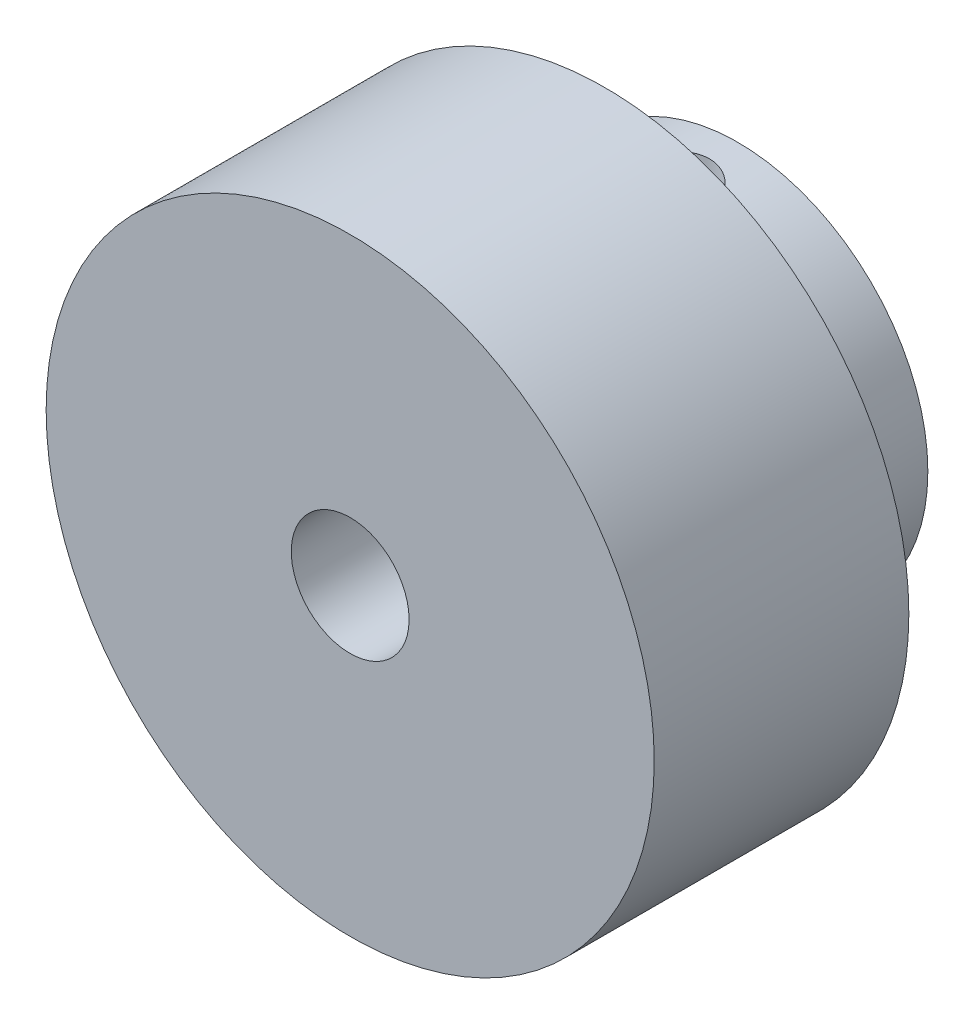
ISO-10303-21;
HEADER;
FILE_DESCRIPTION(('STEP AP214'),'2;1');
FILE_NAME('part.step','',(''),(''),'','','');
FILE_SCHEMA(('AUTOMOTIVE_DESIGN { 1 0 10303 214 1 1 1 1 }'));
ENDSEC;
DATA;
#1=APPLICATION_CONTEXT('core data for automotive mechanical design processes');
#2=APPLICATION_PROTOCOL_DEFINITION('international standard','automotive_design',2000,#1);
#3=PRODUCT_CONTEXT('',#1,'mechanical');
#4=PRODUCT('Part','Part','',(#3));
#5=PRODUCT_RELATED_PRODUCT_CATEGORY('part','',(#4));
#6=PRODUCT_DEFINITION_FORMATION('','',#4);
#7=PRODUCT_DEFINITION_CONTEXT('part definition',#1,'design');
#8=PRODUCT_DEFINITION('design','',#6,#7);
#9=PRODUCT_DEFINITION_SHAPE('','',#8);
#10=(LENGTH_UNIT() NAMED_UNIT(*) SI_UNIT(.MILLI.,.METRE.));
#11=(NAMED_UNIT(*) PLANE_ANGLE_UNIT() SI_UNIT($,.RADIAN.));
#12=(NAMED_UNIT(*) SI_UNIT($,.STERADIAN.) SOLID_ANGLE_UNIT());
#13=UNCERTAINTY_MEASURE_WITH_UNIT(LENGTH_MEASURE(1.E-05),#10,'distance_accuracy_value','');
#14=(GEOMETRIC_REPRESENTATION_CONTEXT(3) GLOBAL_UNCERTAINTY_ASSIGNED_CONTEXT((#13)) GLOBAL_UNIT_ASSIGNED_CONTEXT((#10,
#11,#12)) REPRESENTATION_CONTEXT('',''));
#15=CARTESIAN_POINT('',(0.,0.,0.));
#16=DIRECTION('',(0.,0.,1.));
#17=DIRECTION('',(1.,0.,0.));
#18=AXIS2_PLACEMENT_3D('',#15,#16,#17);
#19=CARTESIAN_POINT('',(0.,0.,-13.7));
#20=DIRECTION('',(0.,0.,1.));
#21=DIRECTION('',(-1.,0.,0.));
#22=AXIS2_PLACEMENT_3D('',#19,#20,#21);
#23=CYLINDRICAL_SURFACE('',#22,10.);
#24=CARTESIAN_POINT('',(0.,0.,-13.7));
#25=DIRECTION('',(0.,0.,1.));
#26=DIRECTION('',(1.,0.,0.));
#27=AXIS2_PLACEMENT_3D('',#24,#25,#26);
#28=CIRCLE('',#27,10.);
#29=CARTESIAN_POINT('',(10.,0.,-13.7));
#30=VERTEX_POINT('',#29);
#31=EDGE_CURVE('E71',#30,#30,#28,.T.);
#32=ORIENTED_EDGE('',*,*,#31,.T.);
#33=EDGE_LOOP('',(#32));
#34=FACE_BOUND('',#33,.T.);
#35=CARTESIAN_POINT('',(0.,0.,-6.7));
#36=DIRECTION('',(0.,0.,1.));
#37=DIRECTION('',(1.,0.,0.));
#38=AXIS2_PLACEMENT_3D('',#35,#36,#37);
#39=CIRCLE('',#38,10.);
#40=CARTESIAN_POINT('',(10.,0.,-6.7));
#41=VERTEX_POINT('',#40);
#42=EDGE_CURVE('E72',#41,#41,#39,.T.);
#43=ORIENTED_EDGE('',*,*,#42,.F.);
#44=EDGE_LOOP('',(#43));
#45=FACE_BOUND('',#44,.T.);
#46=CARTESIAN_POINT('',(0.,10.,-8.2));
#47=CARTESIAN_POINT('',(-0.111153813585266,9.99999795161742,-8.20000408899669));
#48=CARTESIAN_POINT('',(-0.222359320403044,9.99812770356462,-8.20929768593529));
#49=CARTESIAN_POINT('',(-0.441627015378038,9.99084731246463,-8.24619700023049));
#50=CARTESIAN_POINT('',(-0.549686635082711,9.98543435720372,-8.27381726560302));
#51=CARTESIAN_POINT('',(-0.759460610526626,9.97167298556573,-8.34648254724158));
#52=CARTESIAN_POINT('',(-0.861180935866267,9.96332738153436,-8.39151087368938));
#53=CARTESIAN_POINT('',(-1.05561597772845,9.94460796070629,-8.49766449502259));
#54=CARTESIAN_POINT('',(-1.14833123015162,9.93423426471414,-8.55878883121441));
#55=CARTESIAN_POINT('',(-1.32338695462973,9.9124433065994,-8.69627698858287));
#56=CARTESIAN_POINT('',(-1.40558790231705,9.90101491008695,-8.7728167107824));
#57=CARTESIAN_POINT('',(-1.55607351321606,9.87848360905177,-8.9385848327834));
#58=CARTESIAN_POINT('',(-1.62435708954085,9.86738073000848,-9.02781422267024));
#59=CARTESIAN_POINT('',(-1.74566350669524,9.8466488362523,-9.21743238602375));
#60=CARTESIAN_POINT('',(-1.79854187773173,9.83703414729892,-9.31791528759272));
#61=CARTESIAN_POINT('',(-1.88661133316062,9.82052536116836,-9.52656363800816));
#62=CARTESIAN_POINT('',(-1.92180416487448,9.81363099523923,-9.63472832669269));
#63=CARTESIAN_POINT('',(-1.97305059976965,9.80345610504409,-9.85416872781583));
#64=CARTESIAN_POINT('',(-1.98934899591755,9.80012940214375,-9.96538508828445));
#65=CARTESIAN_POINT('',(-2.00310425545224,9.79732750121254,-10.1890196427287));
#66=CARTESIAN_POINT('',(-2.000563045427,9.79785190935681,-10.3014377126403));
#67=CARTESIAN_POINT('',(-1.97690914620364,9.80265102296369,-10.522493576042));
#68=CARTESIAN_POINT('',(-1.95607708048781,9.80686905717527,-10.6311628112546));
#69=CARTESIAN_POINT('',(-1.8968757692461,9.81849092320002,-10.843432153326));
#70=CARTESIAN_POINT('',(-1.85850568620136,9.82589490715558,-10.947032017838));
#71=CARTESIAN_POINT('',(-1.76504956734944,9.84311237000816,-11.1470305234072));
#72=CARTESIAN_POINT('',(-1.70985230246423,9.85294179627409,-11.2433757591383));
#73=CARTESIAN_POINT('',(-1.58438714914536,9.87389237546124,-11.4255416999456));
#74=CARTESIAN_POINT('',(-1.51411752871366,9.88501367676732,-11.5113611937023));
#75=CARTESIAN_POINT('',(-1.35899986912117,9.90754042482924,-11.6716588049139));
#76=CARTESIAN_POINT('',(-1.27391232242489,9.9189473842181,-11.7459051357183));
#77=CARTESIAN_POINT('',(-1.09237004812402,9.94057697428817,-11.8791076926024));
#78=CARTESIAN_POINT('',(-0.99591517475878,9.95079958977947,-11.9380637225872));
#79=CARTESIAN_POINT('',(-0.794118773757843,9.96893380321774,-12.039055018452));
#80=CARTESIAN_POINT('',(-0.688763639170601,9.97684177696544,-12.0810637872891));
#81=CARTESIAN_POINT('',(-0.472297952897331,9.98942817975716,-12.1467209480771));
#82=CARTESIAN_POINT('',(-0.3611881001449,9.99410700001063,-12.1703715641473));
#83=CARTESIAN_POINT('',(-0.138358811254302,9.99965343733735,-12.1983129075886));
#84=CARTESIAN_POINT('',(-0.0266806566511532,10.0005834930494,-12.2029208390805));
#85=CARTESIAN_POINT('',(0.195849868385427,9.99870103860205,-12.1935002821156));
#86=CARTESIAN_POINT('',(0.306702284887586,9.99588873882892,-12.1794728412948));
#87=CARTESIAN_POINT('',(0.523411319893081,9.98687664016035,-12.1334432529121));
#88=CARTESIAN_POINT('',(0.629303896679805,9.98070752808413,-12.1016038630042));
#89=CARTESIAN_POINT('',(0.834247254999334,9.96567104122065,-12.0210320346884));
#90=CARTESIAN_POINT('',(0.933297523275078,9.95680346428454,-11.9722983306463));
#91=CARTESIAN_POINT('',(1.12308234737243,9.93719823066589,-11.8586350186974));
#92=CARTESIAN_POINT('',(1.21370025350438,9.92643900874104,-11.7935144379221));
#93=CARTESIAN_POINT('',(1.38283603823841,9.90429469659765,-11.6491816175854));
#94=CARTESIAN_POINT('',(1.46135261786152,9.89290953936776,-11.5699678672003));
#95=CARTESIAN_POINT('',(1.60528118154835,9.8705860711393,-11.3982532962178));
#96=CARTESIAN_POINT('',(1.67047540489731,9.85965720466609,-11.3055685115573));
#97=CARTESIAN_POINT('',(1.78437084010241,9.83968383592389,-11.1103772772866));
#98=CARTESIAN_POINT('',(1.8330727118458,9.83063925826685,-11.0078712208529));
#99=CARTESIAN_POINT('',(1.91230368316392,9.81553481168766,-10.7964635077009));
#100=CARTESIAN_POINT('',(1.9429269995821,9.80945949744373,-10.6875983175794));
#101=CARTESIAN_POINT('',(1.98541730325439,9.8009487358405,-10.4661330930182));
#102=CARTESIAN_POINT('',(1.99728673645022,9.79851281382223,-10.3535335475813));
#103=CARTESIAN_POINT('',(2.00184182173494,9.79758299262758,-10.1299822709114));
#104=CARTESIAN_POINT('',(1.99487157614179,9.79901838378602,-10.019037702146));
#105=CARTESIAN_POINT('',(1.96270460820012,9.80551146969228,-9.79993670018995));
#106=CARTESIAN_POINT('',(1.9375080322586,9.81056913534338,-9.69178024461039));
#107=CARTESIAN_POINT('',(1.86975713699791,9.82370528438317,-9.48154457751891));
#108=CARTESIAN_POINT('',(1.82724501343469,9.83177642037661,-9.37945127899517));
#109=CARTESIAN_POINT('',(1.72610928920321,9.85003429948341,-9.18379255853112));
#110=CARTESIAN_POINT('',(1.66748433754976,9.86022121997788,-9.09022785254973));
#111=CARTESIAN_POINT('',(1.53461182957283,9.88177921046451,-8.91256885569937));
#112=CARTESIAN_POINT('',(1.46011577447036,9.89316745819399,-8.82866246946481));
#113=CARTESIAN_POINT('',(1.29812873802628,9.91572163743909,-8.67442758894166));
#114=CARTESIAN_POINT('',(1.21063477430667,9.92688751726369,-8.60410221936546));
#115=CARTESIAN_POINT('',(1.02403525817649,9.94787664775943,-8.47833071210711));
#116=CARTESIAN_POINT('',(0.92481776885967,9.95768462438492,-8.42304799343995));
#117=CARTESIAN_POINT('',(0.718332721881466,9.9747025017,-8.33002775480682));
#118=CARTESIAN_POINT('',(0.611072521726253,9.98191474277232,-8.29227442093502));
#119=CARTESIAN_POINT('',(0.419642977847559,9.99152745190741,-8.24269610391057));
#120=CARTESIAN_POINT('',(0.336563328027569,9.99468606316904,-8.22671361258449));
#121=CARTESIAN_POINT('',(0.168999050420133,9.99892308279786,-8.20536417528327));
#122=CARTESIAN_POINT('',(0.0845144674972378,10.0000015574631,-8.19999689098047));
#123=CARTESIAN_POINT('',(0.,10.,-8.2));
#124=B_SPLINE_CURVE_WITH_KNOTS('',3,(#46,#47,#48,#49,#50,#51,#52,#53,#54,#55,#56,#57,#58,#59,
#60,#61,#62,#63,#64,#65,#66,#67,#68,#69,#70,#71,#72,#73,#74,#75,#76,#77,#78,#79,#80,#81,#82,#83,
#84,#85,#86,#87,#88,#89,#90,#91,#92,#93,#94,#95,#96,#97,#98,#99,#100,#101,#102,#103,#104,#105,
#106,#107,#108,#109,#110,#111,#112,#113,#114,#115,#116,#117,#118,#119,#120,#121,#122,#123),
.UNSPECIFIED.,.T.,.F.,(4,2,2,2,2,2,2,2,2,2,2,2,2,2,2,2,2,2,2,2,2,2,2,2,2,2,2,2,2,2,2,2,2,2,2,2,
2,2,4),(0.,0.333152261322516,0.666569301382645,0.999667470500682,1.33274580446173,
1.66986534022437,2.00701119349473,2.34722390011845,2.68740298730395,3.02312370207175,
3.3588100856245,3.68943454012557,4.02007478507459,4.35294980407185,4.68586309499341,
5.02476504982701,5.3636713507964,5.70310549708048,6.04249851396072,6.3762147135253,
6.70991215315735,7.04060907901447,7.37133078432045,7.70610132066717,8.0409077669186,
8.38081257158451,8.72070377446933,9.05880762065446,9.39686736660829,9.72879445135402,
10.0607188698522,10.3918392250622,10.7229873516373,11.0597615247829,11.3966130906586,
11.7369899335127,12.0770591103504,12.3303755057979,12.5836838274199),.UNSPECIFIED.);
#125=CARTESIAN_POINT('',(0.,10.,-8.2));
#126=VERTEX_POINT('',#125);
#127=EDGE_CURVE('E81',#126,#126,#124,.T.);
#128=ORIENTED_EDGE('',*,*,#127,.T.);
#129=EDGE_LOOP('',(#128));
#130=FACE_BOUND('',#129,.T.);
#131=ADVANCED_FACE('F34',(#34,#45,#130),#23,.T.);
#132=CARTESIAN_POINT('',(0.,0.,-13.7));
#133=DIRECTION('',(0.,0.,1.));
#134=DIRECTION('',(-1.,0.,0.));
#135=AXIS2_PLACEMENT_3D('',#132,#133,#134);
#136=CYLINDRICAL_SURFACE('',#135,3.025);
#137=CARTESIAN_POINT('',(0.,0.,-6.7));
#138=DIRECTION('',(0.,0.,1.));
#139=DIRECTION('',(1.,0.,0.));
#140=AXIS2_PLACEMENT_3D('',#137,#138,#139);
#141=CIRCLE('',#140,3.025);
#142=CARTESIAN_POINT('',(3.025,0.,-6.7));
#143=VERTEX_POINT('',#142);
#144=EDGE_CURVE('E78',#143,#143,#141,.T.);
#145=ORIENTED_EDGE('',*,*,#144,.T.);
#146=EDGE_LOOP('',(#145));
#147=FACE_BOUND('',#146,.T.);
#148=CARTESIAN_POINT('',(0.,0.,-13.7));
#149=DIRECTION('',(0.,0.,1.));
#150=DIRECTION('',(1.,0.,0.));
#151=AXIS2_PLACEMENT_3D('',#148,#149,#150);
#152=CIRCLE('',#151,3.025);
#153=CARTESIAN_POINT('',(3.025,0.,-13.7));
#154=VERTEX_POINT('',#153);
#155=EDGE_CURVE('E75',#154,#154,#152,.T.);
#156=ORIENTED_EDGE('',*,*,#155,.F.);
#157=EDGE_LOOP('',(#156));
#158=FACE_BOUND('',#157,.T.);
#159=CARTESIAN_POINT('',(0.,3.025,-8.2));
#160=CARTESIAN_POINT('',(-0.100642617545443,3.0249987783567,-8.20000120399706));
#161=CARTESIAN_POINT('',(-0.201297476451969,3.01993299908086,-8.20763918314828));
#162=CARTESIAN_POINT('',(-0.399407420799123,3.00017112360042,-8.23772383693425));
#163=CARTESIAN_POINT('',(-0.496860581658117,2.98546934240776,-8.26017925352084));
#164=CARTESIAN_POINT('',(-0.685406514791431,2.94788928584531,-8.31853239841244));
#165=CARTESIAN_POINT('',(-0.77652679162158,2.9250494038349,-8.35436704448431));
#166=CARTESIAN_POINT('',(-0.951102248223408,2.87303630646243,-8.43796086625516));
#167=CARTESIAN_POINT('',(-1.03455640299659,2.84386224593824,-8.48572163337046));
#168=CARTESIAN_POINT('',(-1.1993664317277,2.77860517215513,-8.59619850933004));
#169=CARTESIAN_POINT('',(-1.27995339778043,2.74214718793265,-8.65983549631194));
#170=CARTESIAN_POINT('',(-1.43004114549588,2.66695898812271,-8.79806837761625));
#171=CARTESIAN_POINT('',(-1.49952590979975,2.62822559792703,-8.87267981240007));
#172=CARTESIAN_POINT('',(-1.63642694811529,2.54559569213749,-9.04416649867465));
#173=CARTESIAN_POINT('',(-1.70185902015384,2.50182778570157,-9.14270030985283));
#174=CARTESIAN_POINT('',(-1.81513895163526,2.42089760145931,-9.35185343247864));
#175=CARTESIAN_POINT('',(-1.86301722866889,2.38372395524591,-9.4624514031127));
#176=CARTESIAN_POINT('',(-1.92790941909835,2.33131127968343,-9.66080288815675));
#177=CARTESIAN_POINT('',(-1.94983031145749,2.3128404086022,-9.74608882179241));
#178=CARTESIAN_POINT('',(-1.98230173644163,2.28507624082387,-9.92019621834675));
#179=CARTESIAN_POINT('',(-1.99287137832762,2.27576752231628,-10.0090114775415));
#180=CARTESIAN_POINT('',(-2.00197996643278,2.26776224993919,-10.188102308303));
#181=CARTESIAN_POINT('',(-2.00047243567843,2.26910669275792,-10.2783821857446));
#182=CARTESIAN_POINT('',(-1.98542700585713,2.28227832992203,-10.4571854861868));
#183=CARTESIAN_POINT('',(-1.97187893783001,2.29411438504498,-10.5457073598269));
#184=CARTESIAN_POINT('',(-1.93441748703559,2.32577203848501,-10.7150249556095));
#185=CARTESIAN_POINT('',(-1.91095118389035,2.3452468580049,-10.7959886169975));
#186=CARTESIAN_POINT('',(-1.85474587741065,2.38994328199187,-10.9529093217787));
#187=CARTESIAN_POINT('',(-1.82200382976829,2.41516677264586,-11.0288647113465));
#188=CARTESIAN_POINT('',(-1.74062365832931,2.47464586658619,-11.189914970672));
#189=CARTESIAN_POINT('',(-1.69011177897742,2.50969726935146,-11.2737667143711));
#190=CARTESIAN_POINT('',(-1.57789269135683,2.58173148940282,-11.4327776291153));
#191=CARTESIAN_POINT('',(-1.51617174973991,2.61871663588472,-11.5079259496748));
#192=CARTESIAN_POINT('',(-1.36825223388174,2.69944551804657,-11.6634469856888));
#193=CARTESIAN_POINT('',(-1.27963305562048,2.74299173909087,-11.7416455785507));
#194=CARTESIAN_POINT('',(-1.08829088468167,2.82436277312043,-11.8821621524632));
#195=CARTESIAN_POINT('',(-0.985581704313,2.86219311394096,-11.9444955172644));
#196=CARTESIAN_POINT('',(-0.789532778941588,2.92157423058359,-12.0401294705185));
#197=CARTESIAN_POINT('',(-0.698331651394648,2.9448638502207,-12.0767301836017));
#198=CARTESIAN_POINT('',(-0.509974561365827,2.98324682151488,-12.1364045017915));
#199=CARTESIAN_POINT('',(-0.412823666926969,2.99834704378092,-12.1594894474371));
#200=CARTESIAN_POINT('',(-0.214732767837394,3.01901724877256,-12.1909754675224));
#201=CARTESIAN_POINT('',(-0.113778916602817,3.02454808313808,-12.1993162265056));
#202=CARTESIAN_POINT('',(0.0882749032008229,3.02539816006898,-12.2006024658699));
#203=CARTESIAN_POINT('',(0.1893748658806,3.02071780334157,-12.1935485503683));
#204=CARTESIAN_POINT('',(0.381767939018034,3.00226630998737,-12.1654713815535));
#205=CARTESIAN_POINT('',(0.473265865733124,2.9891210741874,-12.1454093059232));
#206=CARTESIAN_POINT('',(0.651304981345677,2.95544286376606,-12.0932545777779));
#207=CARTESIAN_POINT('',(0.737845372463182,2.93490870394887,-12.0611599951939));
#208=CARTESIAN_POINT('',(0.90967129636838,2.88645021717455,-11.9837986244011));
#209=CARTESIAN_POINT('',(0.994525548315691,2.85813838308447,-11.9378228543548));
#210=CARTESIAN_POINT('',(1.15562685582589,2.79688987995517,-11.8351349952313));
#211=CARTESIAN_POINT('',(1.23186824324879,2.76395019694144,-11.7784159009105));
#212=CARTESIAN_POINT('',(1.38625078703641,2.69023227350938,-11.6457657904491));
#213=CARTESIAN_POINT('',(1.46280246171431,2.64903627604967,-11.5682160416802));
#214=CARTESIAN_POINT('',(1.60248518218092,2.56694988781008,-11.4016111254721));
#215=CARTESIAN_POINT('',(1.66560818311131,2.52605969430336,-11.3125491123265));
#216=CARTESIAN_POINT('',(1.77180282800471,2.45256947866062,-11.1330116479057));
#217=CARTESIAN_POINT('',(1.816225542226,2.41955004513944,-11.0435113156178));
#218=CARTESIAN_POINT('',(1.89174612763738,2.36097775731043,-10.8568040613348));
#219=CARTESIAN_POINT('',(1.92286805386102,2.33541145056868,-10.7596114318735));
#220=CARTESIAN_POINT('',(1.96611703059194,2.29905930446256,-10.5763918780719));
#221=CARTESIAN_POINT('',(1.98057383955256,2.2864996133779,-10.491275789339));
#222=CARTESIAN_POINT('',(1.99832459579881,2.27100707562215,-10.3190500244278));
#223=CARTESIAN_POINT('',(2.00162949221253,2.26806478651924,-10.2319423882528));
#224=CARTESIAN_POINT('',(1.99686400840466,2.27226006140056,-10.0582863660211));
#225=CARTESIAN_POINT('',(1.98879215912862,2.27939892714264,-9.97173805363841));
#226=CARTESIAN_POINT('',(1.96180765860033,2.30265967673578,-9.80155537000174));
#227=CARTESIAN_POINT('',(1.94288066764141,2.31879344211434,-9.7179250087073));
#228=CARTESIAN_POINT('',(1.88853640463144,2.36338668506866,-9.53281773634975));
#229=CARTESIAN_POINT('',(1.85000940230073,2.39401916394776,-9.43278671871945));
#230=CARTESIAN_POINT('',(1.75875296775858,2.4618364901973,-9.24186280751888));
#231=CARTESIAN_POINT('',(1.70600376756291,2.49903043253554,-9.15098287671915));
#232=CARTESIAN_POINT('',(1.58660143921209,2.57652397210842,-8.97772806406637));
#233=CARTESIAN_POINT('',(1.51972274368281,2.61686628824138,-8.89552830736306));
#234=CARTESIAN_POINT('',(1.37352970310745,2.69647449530486,-8.7423909046251));
#235=CARTESIAN_POINT('',(1.29421174234045,2.73574006934784,-8.67145654520685));
#236=CARTESIAN_POINT('',(1.11295786075,2.81477128758288,-8.53390374857185));
#237=CARTESIAN_POINT('',(1.00942412682183,2.85394790411945,-8.46902276178671));
#238=CARTESIAN_POINT('',(0.789646169800199,2.9223698098855,-8.3583946535448));
#239=CARTESIAN_POINT('',(0.673425510575367,2.95163311005192,-8.31261279654635));
#240=CARTESIAN_POINT('',(0.46395446902743,2.99057955194841,-8.25235804291387));
#241=CARTESIAN_POINT('',(0.372726683285131,3.00339087807589,-8.23281288538721));
#242=CARTESIAN_POINT('',(0.187668467681292,3.02059926936491,-8.20663698970701));
#243=CARTESIAN_POINT('',(0.0938395550181361,3.02500113906481,-8.19999887738861));
#244=CARTESIAN_POINT('',(0.,3.025,-8.2));
#245=B_SPLINE_CURVE_WITH_KNOTS('',3,(#159,#160,#161,#162,#163,#164,#165,#166,#167,#168,#169,
#170,#171,#172,#173,#174,#175,#176,#177,#178,#179,#180,#181,#182,#183,#184,#185,#186,#187,#188,
#189,#190,#191,#192,#193,#194,#195,#196,#197,#198,#199,#200,#201,#202,#203,#204,#205,#206,#207,
#208,#209,#210,#211,#212,#213,#214,#215,#216,#217,#218,#219,#220,#221,#222,#223,#224,#225,#226,
#227,#228,#229,#230,#231,#232,#233,#234,#235,#236,#237,#238,#239,#240,#241,#242,#243,#244),
.UNSPECIFIED.,.T.,.F.,(4,2,2,2,2,2,2,2,2,2,2,2,2,2,2,2,2,2,2,2,2,2,2,2,2,2,2,2,2,2,2,2,2,2,2,2,
2,2,2,2,2,2,4),(0.,0.3015487261854,0.603275518532284,0.90359729337094,1.20395916445007,
1.5296221539219,1.85575082198353,2.23234945588228,2.60829239236122,2.87713902044293,
3.14553234581872,3.41495903262255,3.6846134829861,3.94322790551536,4.20192730406333,
4.51276392728465,4.8239839889588,5.20005220793539,5.57575437031097,5.87746307605225,
6.17891826595883,6.4816038183107,6.78427749289962,7.06680260771109,7.3493730602407,
7.64994767467169,7.95071895936768,8.29882678891969,8.64714257948896,8.96167116055969,
9.27562847127144,9.53621105204698,9.79653771407239,10.0568979945935,10.3176030073973,
10.6502710247593,10.983403835499,11.3223223758499,11.6613396128591,12.0440942372523,
12.4261496795824,12.7074756225657,12.9886407886918),.UNSPECIFIED.);
#246=CARTESIAN_POINT('',(0.,3.025,-8.2));
#247=VERTEX_POINT('',#246);
#248=EDGE_CURVE('E38',#247,#247,#245,.T.);
#249=ORIENTED_EDGE('',*,*,#248,.F.);
#250=EDGE_LOOP('',(#249));
#251=FACE_BOUND('',#250,.T.);
#252=ADVANCED_FACE('F95',(#147,#158,#251),#136,.F.);
#253=CARTESIAN_POINT('',(0.,0.,-6.7));
#254=DIRECTION('',(0.,0.,-1.));
#255=DIRECTION('',(1.,0.,0.));
#256=AXIS2_PLACEMENT_3D('',#253,#254,#255);
#257=PLANE('',#256);
#258=ORIENTED_EDGE('',*,*,#42,.T.);
#259=EDGE_LOOP('',(#258));
#260=FACE_BOUND('',#259,.T.);
#261=CARTESIAN_POINT('',(0.,0.,-6.7));
#262=DIRECTION('',(0.,0.,1.));
#263=DIRECTION('',(1.,0.,0.));
#264=AXIS2_PLACEMENT_3D('',#261,#262,#263);
#265=CIRCLE('',#264,16.);
#266=CARTESIAN_POINT('',(16.,0.,-6.7));
#267=VERTEX_POINT('',#266);
#268=EDGE_CURVE('E10',#267,#267,#265,.T.);
#269=ORIENTED_EDGE('',*,*,#268,.F.);
#270=EDGE_LOOP('',(#269));
#271=FACE_BOUND('',#270,.T.);
#272=ADVANCED_FACE('F120',(#260,#271),#257,.T.);
#273=CARTESIAN_POINT('',(0.,0.,6.7));
#274=DIRECTION('',(0.,0.,-1.));
#275=DIRECTION('',(1.,0.,0.));
#276=AXIS2_PLACEMENT_3D('',#273,#274,#275);
#277=PLANE('',#276);
#278=CARTESIAN_POINT('',(0.,0.,6.7));
#279=DIRECTION('',(0.,0.,1.));
#280=DIRECTION('',(1.,0.,0.));
#281=AXIS2_PLACEMENT_3D('',#278,#279,#280);
#282=CIRCLE('',#281,16.);
#283=CARTESIAN_POINT('',(16.,0.,6.7));
#284=VERTEX_POINT('',#283);
#285=EDGE_CURVE('E47',#284,#284,#282,.T.);
#286=ORIENTED_EDGE('',*,*,#285,.T.);
#287=EDGE_LOOP('',(#286));
#288=FACE_BOUND('',#287,.T.);
#289=CARTESIAN_POINT('',(0.,0.,6.7));
#290=DIRECTION('',(0.,0.,1.));
#291=DIRECTION('',(1.,0.,0.));
#292=AXIS2_PLACEMENT_3D('',#289,#290,#291);
#293=CIRCLE('',#292,3.1);
#294=CARTESIAN_POINT('',(3.1,0.,6.7));
#295=VERTEX_POINT('',#294);
#296=EDGE_CURVE('E52',#295,#295,#293,.T.);
#297=ORIENTED_EDGE('',*,*,#296,.F.);
#298=EDGE_LOOP('',(#297));
#299=FACE_BOUND('',#298,.T.);
#300=ADVANCED_FACE('F122',(#288,#299),#277,.F.);
#301=CARTESIAN_POINT('',(0.,0.,-6.7));
#302=DIRECTION('',(0.,0.,1.));
#303=DIRECTION('',(-1.,0.,0.));
#304=AXIS2_PLACEMENT_3D('',#301,#302,#303);
#305=CYLINDRICAL_SURFACE('',#304,16.);
#306=ORIENTED_EDGE('',*,*,#268,.T.);
#307=EDGE_LOOP('',(#306));
#308=FACE_BOUND('',#307,.T.);
#309=ORIENTED_EDGE('',*,*,#285,.F.);
#310=EDGE_LOOP('',(#309));
#311=FACE_BOUND('',#310,.T.);
#312=ADVANCED_FACE('F36',(#308,#311),#305,.T.);
#313=CARTESIAN_POINT('',(0.,0.,-6.7));
#314=DIRECTION('',(0.,0.,1.));
#315=DIRECTION('',(-1.,0.,0.));
#316=AXIS2_PLACEMENT_3D('',#313,#314,#315);
#317=CYLINDRICAL_SURFACE('',#316,3.1);
#318=CARTESIAN_POINT('',(0.,0.,-6.7));
#319=DIRECTION('',(0.,0.,1.));
#320=DIRECTION('',(1.,0.,0.));
#321=AXIS2_PLACEMENT_3D('',#318,#319,#320);
#322=CIRCLE('',#321,3.1);
#323=CARTESIAN_POINT('',(3.1,0.,-6.7));
#324=VERTEX_POINT('',#323);
#325=EDGE_CURVE('E66',#324,#324,#322,.T.);
#326=ORIENTED_EDGE('',*,*,#325,.F.);
#327=EDGE_LOOP('',(#326));
#328=FACE_BOUND('',#327,.T.);
#329=ORIENTED_EDGE('',*,*,#296,.T.);
#330=EDGE_LOOP('',(#329));
#331=FACE_BOUND('',#330,.T.);
#332=ADVANCED_FACE('F116',(#328,#331),#317,.F.);
#333=CARTESIAN_POINT('',(0.,0.,-6.7));
#334=DIRECTION('',(0.,0.,-1.));
#335=DIRECTION('',(1.,0.,0.));
#336=AXIS2_PLACEMENT_3D('',#333,#334,#335);
#337=PLANE('',#336);
#338=ORIENTED_EDGE('',*,*,#144,.F.);
#339=EDGE_LOOP('',(#338));
#340=FACE_BOUND('',#339,.T.);
#341=ORIENTED_EDGE('',*,*,#325,.T.);
#342=EDGE_LOOP('',(#341));
#343=FACE_BOUND('',#342,.T.);
#344=ADVANCED_FACE('F97',(#340,#343),#337,.F.);
#345=CARTESIAN_POINT('',(0.,0.,-13.7));
#346=DIRECTION('',(0.,0.,-1.));
#347=DIRECTION('',(1.,0.,0.));
#348=AXIS2_PLACEMENT_3D('',#345,#346,#347);
#349=PLANE('',#348);
#350=ORIENTED_EDGE('',*,*,#31,.F.);
#351=EDGE_LOOP('',(#350));
#352=FACE_BOUND('',#351,.T.);
#353=ORIENTED_EDGE('',*,*,#155,.T.);
#354=EDGE_LOOP('',(#353));
#355=FACE_BOUND('',#354,.T.);
#356=ADVANCED_FACE('F146',(#352,#355),#349,.T.);
#357=CARTESIAN_POINT('',(0.,16.,-10.2));
#358=DIRECTION('',(0.,-1.,0.));
#359=DIRECTION('',(0.,0.,1.));
#360=AXIS2_PLACEMENT_3D('',#357,#358,#359);
#361=CYLINDRICAL_SURFACE('',#360,2.);
#362=ORIENTED_EDGE('',*,*,#248,.T.);
#363=EDGE_LOOP('',(#362));
#364=FACE_BOUND('',#363,.T.);
#365=ORIENTED_EDGE('',*,*,#127,.F.);
#366=EDGE_LOOP('',(#365));
#367=FACE_BOUND('',#366,.T.);
#368=ADVANCED_FACE('F89',(#364,#367),#361,.F.);
#369=CLOSED_SHELL('',(#131,#252,#272,#300,#312,#332,#344,#356,#368));
#370=CARTESIAN_POINT('',(0.,0.,5.15));
#371=DIRECTION('',(0.,0.,-1.));
#372=DIRECTION('',(1.,0.,0.));
#373=AXIS2_PLACEMENT_3D('',#370,#371,#372);
#374=CYLINDRICAL_SURFACE('',#373,13.6604075348495);
#375=CARTESIAN_POINT('',(0.,0.,5.15));
#376=DIRECTION('',(0.,0.,1.));
#377=DIRECTION('',(1.,0.,0.));
#378=AXIS2_PLACEMENT_3D('',#375,#376,#377);
#379=CIRCLE('',#378,13.6604075348495);
#380=CARTESIAN_POINT('',(13.6604075348495,0.,5.15));
#381=VERTEX_POINT('',#380);
#382=EDGE_CURVE('E56',#381,#381,#379,.T.);
#383=CARTESIAN_POINT('',(0.,0.,-5.15));
#384=DIRECTION('',(0.,0.,1.));
#385=DIRECTION('',(1.,0.,0.));
#386=AXIS2_PLACEMENT_3D('',#383,#384,#385);
#387=CIRCLE('',#386,13.6604075348495);
#388=CARTESIAN_POINT('',(13.6604075348495,0.,-5.15));
#389=VERTEX_POINT('',#388);
#390=EDGE_CURVE('E57',#389,#389,#387,.T.);
#391=CARTESIAN_POINT('',(13.6604075348495,0.,5.15));
#392=CARTESIAN_POINT('',(13.6604075348495,0.,5.04270833333333));
#393=CARTESIAN_POINT('',(13.6604075348495,0.,4.93541666666667));
#394=CARTESIAN_POINT('',(13.6604075348495,0.,4.72083333333333));
#395=CARTESIAN_POINT('',(13.6604075348495,0.,4.61354166666667));
#396=CARTESIAN_POINT('',(13.6604075348495,0.,4.39895833333333));
#397=CARTESIAN_POINT('',(13.6604075348495,0.,4.29166666666667));
#398=CARTESIAN_POINT('',(13.6604075348495,0.,4.07708333333333));
#399=CARTESIAN_POINT('',(13.6604075348495,0.,3.96979166666667));
#400=CARTESIAN_POINT('',(13.6604075348495,0.,3.75520833333333));
#401=CARTESIAN_POINT('',(13.6604075348495,0.,3.64791666666667));
#402=CARTESIAN_POINT('',(13.6604075348495,0.,3.43333333333333));
#403=CARTESIAN_POINT('',(13.6604075348495,0.,3.32604166666667));
#404=CARTESIAN_POINT('',(13.6604075348495,0.,3.11145833333333));
#405=CARTESIAN_POINT('',(13.6604075348495,0.,3.00416666666667));
#406=CARTESIAN_POINT('',(13.6604075348495,0.,2.78958333333333));
#407=CARTESIAN_POINT('',(13.6604075348495,0.,2.68229166666667));
#408=CARTESIAN_POINT('',(13.6604075348495,0.,2.46770833333333));
#409=CARTESIAN_POINT('',(13.6604075348495,0.,2.36041666666667));
#410=CARTESIAN_POINT('',(13.6604075348495,0.,2.14583333333333));
#411=CARTESIAN_POINT('',(13.6604075348495,0.,2.03854166666667));
#412=CARTESIAN_POINT('',(13.6604075348495,0.,1.82395833333333));
#413=CARTESIAN_POINT('',(13.6604075348495,0.,1.71666666666667));
#414=CARTESIAN_POINT('',(13.6604075348495,0.,1.50208333333333));
#415=CARTESIAN_POINT('',(13.6604075348495,0.,1.39479166666667));
#416=CARTESIAN_POINT('',(13.6604075348495,0.,1.18020833333333));
#417=CARTESIAN_POINT('',(13.6604075348495,0.,1.07291666666667));
#418=CARTESIAN_POINT('',(13.6604075348495,0.,0.858333333333332));
#419=CARTESIAN_POINT('',(13.6604075348495,0.,0.751041666666665));
#420=CARTESIAN_POINT('',(13.6604075348495,0.,0.536458333333332));
#421=CARTESIAN_POINT('',(13.6604075348495,0.,0.429166666666665));
#422=CARTESIAN_POINT('',(13.6604075348495,0.,0.214583333333332));
#423=CARTESIAN_POINT('',(13.6604075348495,0.,0.107291666666665));
#424=CARTESIAN_POINT('',(13.6604075348495,0.,-0.107291666666668));
#425=CARTESIAN_POINT('',(13.6604075348495,0.,-0.214583333333335));
#426=CARTESIAN_POINT('',(13.6604075348495,0.,-0.429166666666669));
#427=CARTESIAN_POINT('',(13.6604075348495,0.,-0.536458333333335));
#428=CARTESIAN_POINT('',(13.6604075348495,0.,-0.751041666666669));
#429=CARTESIAN_POINT('',(13.6604075348495,0.,-0.858333333333335));
#430=CARTESIAN_POINT('',(13.6604075348495,0.,-1.07291666666667));
#431=CARTESIAN_POINT('',(13.6604075348495,0.,-1.18020833333334));
#432=CARTESIAN_POINT('',(13.6604075348495,0.,-1.39479166666667));
#433=CARTESIAN_POINT('',(13.6604075348495,0.,-1.50208333333334));
#434=CARTESIAN_POINT('',(13.6604075348495,0.,-1.71666666666667));
#435=CARTESIAN_POINT('',(13.6604075348495,0.,-1.82395833333334));
#436=CARTESIAN_POINT('',(13.6604075348495,0.,-2.03854166666667));
#437=CARTESIAN_POINT('',(13.6604075348495,0.,-2.14583333333334));
#438=CARTESIAN_POINT('',(13.6604075348495,0.,-2.36041666666667));
#439=CARTESIAN_POINT('',(13.6604075348495,0.,-2.46770833333334));
#440=CARTESIAN_POINT('',(13.6604075348495,0.,-2.68229166666667));
#441=CARTESIAN_POINT('',(13.6604075348495,0.,-2.78958333333333));
#442=CARTESIAN_POINT('',(13.6604075348495,0.,-3.00416666666667));
#443=CARTESIAN_POINT('',(13.6604075348495,0.,-3.11145833333333));
#444=CARTESIAN_POINT('',(13.6604075348495,0.,-3.32604166666667));
#445=CARTESIAN_POINT('',(13.6604075348495,0.,-3.43333333333333));
#446=CARTESIAN_POINT('',(13.6604075348495,0.,-3.64791666666667));
#447=CARTESIAN_POINT('',(13.6604075348495,0.,-3.75520833333333));
#448=CARTESIAN_POINT('',(13.6604075348495,0.,-3.96979166666667));
#449=CARTESIAN_POINT('',(13.6604075348495,0.,-4.07708333333333));
#450=CARTESIAN_POINT('',(13.6604075348495,0.,-4.29166666666667));
#451=CARTESIAN_POINT('',(13.6604075348495,0.,-4.39895833333333));
#452=CARTESIAN_POINT('',(13.6604075348495,0.,-4.61354166666667));
#453=CARTESIAN_POINT('',(13.6604075348495,0.,-4.72083333333334));
#454=CARTESIAN_POINT('',(13.6604075348495,0.,-4.93541666666667));
#455=CARTESIAN_POINT('',(13.6604075348495,0.,-5.04270833333334));
#456=CARTESIAN_POINT('',(13.6604075348495,0.,-5.15));
#457=B_SPLINE_CURVE_WITH_KNOTS('',3,(#391,#392,#393,#394,#395,#396,#397,#398,#399,#400,#401,
#402,#403,#404,#405,#406,#407,#408,#409,#410,#411,#412,#413,#414,#415,#416,#417,#418,#419,#420,
#421,#422,#423,#424,#425,#426,#427,#428,#429,#430,#431,#432,#433,#434,#435,#436,#437,#438,#439,
#440,#441,#442,#443,#444,#445,#446,#447,#448,#449,#450,#451,#452,#453,#454,#455,#456),
.UNSPECIFIED.,.F.,.F.,(4,2,2,2,2,2,2,2,2,2,2,2,2,2,2,2,2,2,2,2,2,2,2,2,2,2,2,2,2,2,2,2,4),(0.,
0.321874999999999,0.643749999999999,0.965625,1.2875,1.609375,1.93125,2.253125,2.575,2.896875,
3.21875,3.540625,3.8625,4.184375,4.50625,4.828125,5.15,5.471875,5.79375,6.115625,6.4375,
6.759375,7.08125,7.403125,7.725,8.046875,8.36875,8.690625,9.0125,9.334375,9.65625,9.978125,
10.3),.UNSPECIFIED.);
#458=EDGE_CURVE('BSEAM108',#381,#389,#457,.T.);
#459=ORIENTED_EDGE('',*,*,#382,.T.);
#460=ORIENTED_EDGE('',*,*,#390,.F.);
#461=ORIENTED_EDGE('',*,*,#458,.T.);
#462=ORIENTED_EDGE('',*,*,#458,.F.);
#463=EDGE_LOOP('',(#459,#461,#460,#462));
#464=FACE_BOUND('',#463,.T.);
#465=ADVANCED_FACE('F108',(#464),#374,.F.);
#466=CARTESIAN_POINT('',(0.,0.,5.15));
#467=DIRECTION('',(0.,0.,-1.));
#468=DIRECTION('',(1.,0.,0.));
#469=AXIS2_PLACEMENT_3D('',#466,#467,#468);
#470=PLANE('',#469);
#471=CARTESIAN_POINT('',(0.,0.,5.15));
#472=DIRECTION('',(0.,0.,1.));
#473=DIRECTION('',(1.,0.,0.));
#474=AXIS2_PLACEMENT_3D('',#471,#472,#473);
#475=CIRCLE('',#474,7.85);
#476=CARTESIAN_POINT('',(7.85,0.,5.15));
#477=VERTEX_POINT('',#476);
#478=EDGE_CURVE('E60',#477,#477,#475,.T.);
#479=ORIENTED_EDGE('',*,*,#478,.T.);
#480=EDGE_LOOP('',(#479));
#481=FACE_BOUND('',#480,.T.);
#482=ORIENTED_EDGE('',*,*,#382,.F.);
#483=EDGE_LOOP('',(#482));
#484=FACE_BOUND('',#483,.T.);
#485=ADVANCED_FACE('F105',(#481,#484),#470,.T.);
#486=CARTESIAN_POINT('',(0.,0.,-5.15));
#487=DIRECTION('',(0.,0.,-1.));
#488=DIRECTION('',(1.,0.,0.));
#489=AXIS2_PLACEMENT_3D('',#486,#487,#488);
#490=PLANE('',#489);
#491=CARTESIAN_POINT('',(0.,0.,-5.15));
#492=DIRECTION('',(0.,0.,1.));
#493=DIRECTION('',(1.,0.,0.));
#494=AXIS2_PLACEMENT_3D('',#491,#492,#493);
#495=CIRCLE('',#494,7.85);
#496=CARTESIAN_POINT('',(7.85,0.,-5.15));
#497=VERTEX_POINT('',#496);
#498=EDGE_CURVE('E63',#497,#497,#495,.T.);
#499=ORIENTED_EDGE('',*,*,#498,.F.);
#500=EDGE_LOOP('',(#499));
#501=FACE_BOUND('',#500,.T.);
#502=ORIENTED_EDGE('',*,*,#390,.T.);
#503=EDGE_LOOP('',(#502));
#504=FACE_BOUND('',#503,.T.);
#505=ADVANCED_FACE('F102',(#501,#504),#490,.F.);
#506=CARTESIAN_POINT('',(0.,0.,5.15));
#507=DIRECTION('',(0.,0.,-1.));
#508=DIRECTION('',(1.,0.,0.));
#509=AXIS2_PLACEMENT_3D('',#506,#507,#508);
#510=CYLINDRICAL_SURFACE('',#509,7.85);
#511=CARTESIAN_POINT('',(7.85,0.,5.15));
#512=CARTESIAN_POINT('',(7.85,0.,5.04270833333333));
#513=CARTESIAN_POINT('',(7.85,0.,4.93541666666667));
#514=CARTESIAN_POINT('',(7.85,0.,4.72083333333333));
#515=CARTESIAN_POINT('',(7.85,0.,4.61354166666667));
#516=CARTESIAN_POINT('',(7.85,0.,4.39895833333333));
#517=CARTESIAN_POINT('',(7.85,0.,4.29166666666667));
#518=CARTESIAN_POINT('',(7.85,0.,4.07708333333333));
#519=CARTESIAN_POINT('',(7.85,0.,3.96979166666667));
#520=CARTESIAN_POINT('',(7.85,0.,3.75520833333333));
#521=CARTESIAN_POINT('',(7.85,0.,3.64791666666667));
#522=CARTESIAN_POINT('',(7.85,0.,3.43333333333333));
#523=CARTESIAN_POINT('',(7.85,0.,3.32604166666667));
#524=CARTESIAN_POINT('',(7.85,0.,3.11145833333333));
#525=CARTESIAN_POINT('',(7.85,0.,3.00416666666667));
#526=CARTESIAN_POINT('',(7.85,0.,2.78958333333333));
#527=CARTESIAN_POINT('',(7.85,0.,2.68229166666667));
#528=CARTESIAN_POINT('',(7.85,0.,2.46770833333333));
#529=CARTESIAN_POINT('',(7.85,0.,2.36041666666667));
#530=CARTESIAN_POINT('',(7.85,0.,2.14583333333333));
#531=CARTESIAN_POINT('',(7.85,0.,2.03854166666667));
#532=CARTESIAN_POINT('',(7.85,0.,1.82395833333333));
#533=CARTESIAN_POINT('',(7.85,0.,1.71666666666667));
#534=CARTESIAN_POINT('',(7.85,0.,1.50208333333333));
#535=CARTESIAN_POINT('',(7.85,0.,1.39479166666667));
#536=CARTESIAN_POINT('',(7.85,0.,1.18020833333333));
#537=CARTESIAN_POINT('',(7.85,0.,1.07291666666667));
#538=CARTESIAN_POINT('',(7.85,0.,0.858333333333332));
#539=CARTESIAN_POINT('',(7.85,0.,0.751041666666665));
#540=CARTESIAN_POINT('',(7.85,0.,0.536458333333332));
#541=CARTESIAN_POINT('',(7.85,0.,0.429166666666665));
#542=CARTESIAN_POINT('',(7.85,0.,0.214583333333332));
#543=CARTESIAN_POINT('',(7.85,0.,0.107291666666665));
#544=CARTESIAN_POINT('',(7.85,0.,-0.107291666666668));
#545=CARTESIAN_POINT('',(7.85,0.,-0.214583333333335));
#546=CARTESIAN_POINT('',(7.85,0.,-0.429166666666669));
#547=CARTESIAN_POINT('',(7.85,0.,-0.536458333333335));
#548=CARTESIAN_POINT('',(7.85,0.,-0.751041666666669));
#549=CARTESIAN_POINT('',(7.85,0.,-0.858333333333335));
#550=CARTESIAN_POINT('',(7.85,0.,-1.07291666666667));
#551=CARTESIAN_POINT('',(7.85,0.,-1.18020833333334));
#552=CARTESIAN_POINT('',(7.85,0.,-1.39479166666667));
#553=CARTESIAN_POINT('',(7.85,0.,-1.50208333333334));
#554=CARTESIAN_POINT('',(7.85,0.,-1.71666666666667));
#555=CARTESIAN_POINT('',(7.85,0.,-1.82395833333334));
#556=CARTESIAN_POINT('',(7.85,0.,-2.03854166666667));
#557=CARTESIAN_POINT('',(7.85,0.,-2.14583333333334));
#558=CARTESIAN_POINT('',(7.85,0.,-2.36041666666667));
#559=CARTESIAN_POINT('',(7.85,0.,-2.46770833333334));
#560=CARTESIAN_POINT('',(7.85,0.,-2.68229166666667));
#561=CARTESIAN_POINT('',(7.85,0.,-2.78958333333333));
#562=CARTESIAN_POINT('',(7.85,0.,-3.00416666666667));
#563=CARTESIAN_POINT('',(7.85,0.,-3.11145833333333));
#564=CARTESIAN_POINT('',(7.85,0.,-3.32604166666667));
#565=CARTESIAN_POINT('',(7.85,0.,-3.43333333333333));
#566=CARTESIAN_POINT('',(7.85,0.,-3.64791666666667));
#567=CARTESIAN_POINT('',(7.85,0.,-3.75520833333333));
#568=CARTESIAN_POINT('',(7.85,0.,-3.96979166666667));
#569=CARTESIAN_POINT('',(7.85,0.,-4.07708333333333));
#570=CARTESIAN_POINT('',(7.85,0.,-4.29166666666667));
#571=CARTESIAN_POINT('',(7.85,0.,-4.39895833333333));
#572=CARTESIAN_POINT('',(7.85,0.,-4.61354166666667));
#573=CARTESIAN_POINT('',(7.85,0.,-4.72083333333334));
#574=CARTESIAN_POINT('',(7.85,0.,-4.93541666666667));
#575=CARTESIAN_POINT('',(7.85,0.,-5.04270833333334));
#576=CARTESIAN_POINT('',(7.85,0.,-5.15));
#577=B_SPLINE_CURVE_WITH_KNOTS('',3,(#511,#512,#513,#514,#515,#516,#517,#518,#519,#520,#521,
#522,#523,#524,#525,#526,#527,#528,#529,#530,#531,#532,#533,#534,#535,#536,#537,#538,#539,#540,
#541,#542,#543,#544,#545,#546,#547,#548,#549,#550,#551,#552,#553,#554,#555,#556,#557,#558,#559,
#560,#561,#562,#563,#564,#565,#566,#567,#568,#569,#570,#571,#572,#573,#574,#575,#576),
.UNSPECIFIED.,.F.,.F.,(4,2,2,2,2,2,2,2,2,2,2,2,2,2,2,2,2,2,2,2,2,2,2,2,2,2,2,2,2,2,2,2,4),(0.,
0.321874999999999,0.643749999999999,0.965625,1.2875,1.609375,1.93125,2.253125,2.575,2.896875,
3.21875,3.540625,3.8625,4.184375,4.50625,4.828125,5.15,5.471875,5.79375,6.115625,6.4375,
6.759375,7.08125,7.403125,7.725,8.046875,8.36875,8.690625,9.0125,9.334375,9.65625,9.978125,
10.3),.UNSPECIFIED.);
#578=EDGE_CURVE('BSEAM99',#477,#497,#577,.T.);
#579=ORIENTED_EDGE('',*,*,#478,.F.);
#580=ORIENTED_EDGE('',*,*,#498,.T.);
#581=ORIENTED_EDGE('',*,*,#578,.T.);
#582=ORIENTED_EDGE('',*,*,#578,.F.);
#583=EDGE_LOOP('',(#579,#581,#580,#582));
#584=FACE_BOUND('',#583,.T.);
#585=ADVANCED_FACE('F99',(#584),#510,.T.);
#586=CLOSED_SHELL('',(#465,#485,#505,#585));
#587=ORIENTED_CLOSED_SHELL('',*,#586,.T.);
#588=BREP_WITH_VOIDS('B2',#369,(#587));
#589=ADVANCED_BREP_SHAPE_REPRESENTATION('',(#18,#588),#14);
#590=SHAPE_DEFINITION_REPRESENTATION(#9,#589);
ENDSEC;
END-ISO-10303-21;
